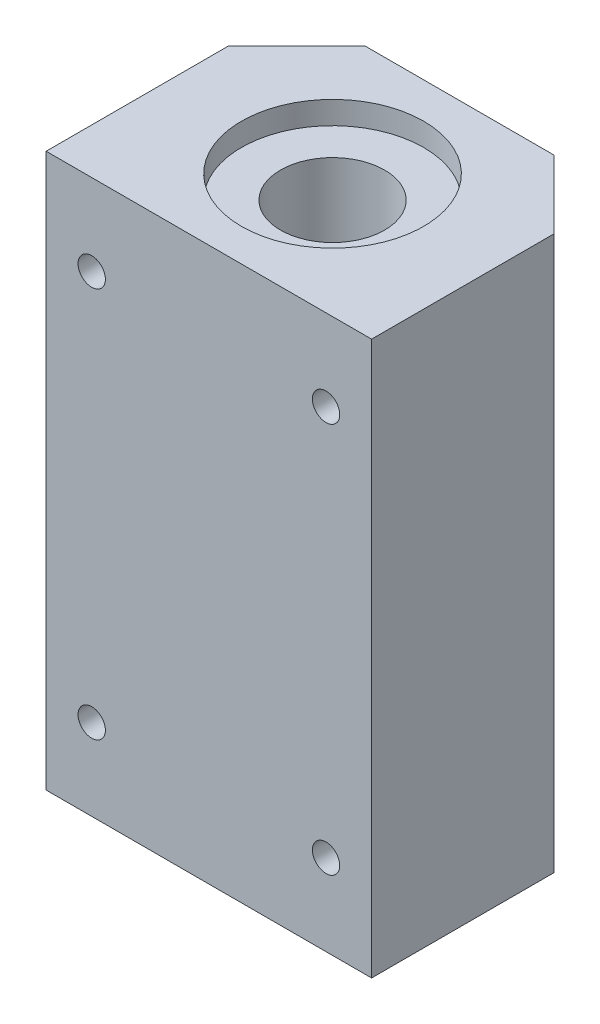
ISO-10303-21;
HEADER;
FILE_DESCRIPTION(('STEP AP214'),'2;1');
FILE_NAME('part.step','',(''),(''),'','','');
FILE_SCHEMA(('AUTOMOTIVE_DESIGN { 1 0 10303 214 1 1 1 1 }'));
ENDSEC;
DATA;
#1=APPLICATION_CONTEXT('core data for automotive mechanical design processes');
#2=APPLICATION_PROTOCOL_DEFINITION('international standard','automotive_design',2000,#1);
#3=PRODUCT_CONTEXT('',#1,'mechanical');
#4=PRODUCT('Part','Part','',(#3));
#5=PRODUCT_RELATED_PRODUCT_CATEGORY('part','',(#4));
#6=PRODUCT_DEFINITION_FORMATION('','',#4);
#7=PRODUCT_DEFINITION_CONTEXT('part definition',#1,'design');
#8=PRODUCT_DEFINITION('design','',#6,#7);
#9=PRODUCT_DEFINITION_SHAPE('','',#8);
#10=(LENGTH_UNIT() NAMED_UNIT(*) SI_UNIT(.MILLI.,.METRE.));
#11=(NAMED_UNIT(*) PLANE_ANGLE_UNIT() SI_UNIT($,.RADIAN.));
#12=(NAMED_UNIT(*) SI_UNIT($,.STERADIAN.) SOLID_ANGLE_UNIT());
#13=UNCERTAINTY_MEASURE_WITH_UNIT(LENGTH_MEASURE(1.E-05),#10,'distance_accuracy_value','');
#14=(GEOMETRIC_REPRESENTATION_CONTEXT(3) GLOBAL_UNCERTAINTY_ASSIGNED_CONTEXT((#13)) GLOBAL_UNIT_ASSIGNED_CONTEXT((#10,
#11,#12)) REPRESENTATION_CONTEXT('',''));
#15=CARTESIAN_POINT('',(0.,0.,0.));
#16=DIRECTION('',(0.,0.,1.));
#17=DIRECTION('',(1.,0.,0.));
#18=AXIS2_PLACEMENT_3D('',#15,#16,#17);
#19=CARTESIAN_POINT('',(0.,-42.5,19.5));
#20=DIRECTION('',(0.,1.,0.));
#21=DIRECTION('',(0.,0.,1.));
#22=AXIS2_PLACEMENT_3D('',#19,#20,#21);
#23=CYLINDRICAL_SURFACE('',#22,14.);
#24=CARTESIAN_POINT('',(0.,42.5,19.5));
#25=DIRECTION('',(0.,1.,0.));
#26=DIRECTION('',(0.,0.,1.));
#27=AXIS2_PLACEMENT_3D('',#24,#25,#26);
#28=CIRCLE('',#27,14.);
#29=CARTESIAN_POINT('',(0.,42.5,33.5));
#30=VERTEX_POINT('',#29);
#31=EDGE_CURVE('E154',#30,#30,#28,.T.);
#32=ORIENTED_EDGE('',*,*,#31,.T.);
#33=EDGE_LOOP('',(#32));
#34=FACE_BOUND('',#33,.T.);
#35=CARTESIAN_POINT('',(0.,39.,19.5));
#36=DIRECTION('',(0.,-1.,0.));
#37=DIRECTION('',(0.,0.,-1.));
#38=AXIS2_PLACEMENT_3D('',#35,#36,#37);
#39=CIRCLE('',#38,14.);
#40=CARTESIAN_POINT('',(0.,39.,5.49999999999999));
#41=VERTEX_POINT('',#40);
#42=EDGE_CURVE('E11',#41,#41,#39,.F.);
#43=ORIENTED_EDGE('',*,*,#42,.F.);
#44=EDGE_LOOP('',(#43));
#45=FACE_BOUND('',#44,.T.);
#46=ADVANCED_FACE('F43',(#34,#45),#23,.F.);
#47=CARTESIAN_POINT('',(25.,42.5,38.5));
#48=DIRECTION('',(-1.,0.,0.));
#49=DIRECTION('',(0.,-1.,0.));
#50=AXIS2_PLACEMENT_3D('',#47,#48,#49);
#51=PLANE('',#50);
#52=DIRECTION('',(0.,0.,-1.));
#53=VECTOR('',#52,1.);
#54=CARTESIAN_POINT('',(25.,-42.5,38.5));
#55=LINE('',#54,#53);
#56=CARTESIAN_POINT('',(25.,-42.5,38.5));
#57=VERTEX_POINT('',#56);
#58=CARTESIAN_POINT('',(25.,-42.5,10.5));
#59=VERTEX_POINT('',#58);
#60=EDGE_CURVE('E122',#57,#59,#55,.T.);
#61=ORIENTED_EDGE('',*,*,#60,.T.);
#62=DIRECTION('',(0.,1.,0.));
#63=VECTOR('',#62,1.);
#64=CARTESIAN_POINT('',(25.,-42.5,10.5));
#65=LINE('',#64,#63);
#66=CARTESIAN_POINT('',(25.,42.5,10.5));
#67=VERTEX_POINT('',#66);
#68=EDGE_CURVE('E195',#59,#67,#65,.T.);
#69=ORIENTED_EDGE('',*,*,#68,.T.);
#70=DIRECTION('',(0.,0.,-1.));
#71=VECTOR('',#70,1.);
#72=CARTESIAN_POINT('',(25.,42.5,38.5));
#73=LINE('',#72,#71);
#74=CARTESIAN_POINT('',(25.,42.5,38.5));
#75=VERTEX_POINT('',#74);
#76=EDGE_CURVE('E52',#75,#67,#73,.T.);
#77=ORIENTED_EDGE('',*,*,#76,.F.);
#78=DIRECTION('',(0.,1.,0.));
#79=VECTOR('',#78,1.);
#80=CARTESIAN_POINT('',(25.,42.5,38.5));
#81=LINE('',#80,#79);
#82=EDGE_CURVE('E173',#57,#75,#81,.T.);
#83=ORIENTED_EDGE('',*,*,#82,.F.);
#84=EDGE_LOOP('',(#61,#69,#77,#83));
#85=FACE_BOUND('',#84,.T.);
#86=ADVANCED_FACE('F45',(#85),#51,.F.);
#87=CARTESIAN_POINT('',(-25.,42.5,38.5));
#88=DIRECTION('',(0.,-1.,0.));
#89=DIRECTION('',(0.,0.,-1.));
#90=AXIS2_PLACEMENT_3D('',#87,#88,#89);
#91=PLANE('',#90);
#92=ORIENTED_EDGE('',*,*,#31,.F.);
#93=EDGE_LOOP('',(#92));
#94=FACE_BOUND('',#93,.T.);
#95=DIRECTION('',(-1.,0.,0.));
#96=VECTOR('',#95,1.);
#97=CARTESIAN_POINT('',(-25.,42.5,0.));
#98=LINE('',#97,#96);
#99=CARTESIAN_POINT('',(14.5,42.5,0.));
#100=VERTEX_POINT('',#99);
#101=CARTESIAN_POINT('',(-14.5,42.5,0.));
#102=VERTEX_POINT('',#101);
#103=EDGE_CURVE('E172',#100,#102,#98,.T.);
#104=ORIENTED_EDGE('',*,*,#103,.T.);
#105=DIRECTION('',(0.707106781186548,0.,-0.707106781186547));
#106=VECTOR('',#105,1.);
#107=CARTESIAN_POINT('',(-25.,42.5,10.5));
#108=LINE('',#107,#106);
#109=CARTESIAN_POINT('',(-25.,42.5,10.5));
#110=VERTEX_POINT('',#109);
#111=EDGE_CURVE('E59',#110,#102,#108,.T.);
#112=ORIENTED_EDGE('',*,*,#111,.F.);
#113=DIRECTION('',(0.,0.,-1.));
#114=VECTOR('',#113,1.);
#115=CARTESIAN_POINT('',(-25.,42.5,38.5));
#116=LINE('',#115,#114);
#117=CARTESIAN_POINT('',(-25.,42.5,38.5));
#118=VERTEX_POINT('',#117);
#119=EDGE_CURVE('E115',#118,#110,#116,.T.);
#120=ORIENTED_EDGE('',*,*,#119,.F.);
#121=DIRECTION('',(-1.,0.,0.));
#122=VECTOR('',#121,1.);
#123=CARTESIAN_POINT('',(-25.,42.5,38.5));
#124=LINE('',#123,#122);
#125=EDGE_CURVE('E177',#75,#118,#124,.T.);
#126=ORIENTED_EDGE('',*,*,#125,.F.);
#127=ORIENTED_EDGE('',*,*,#76,.T.);
#128=DIRECTION('',(0.707106781186548,0.,0.707106781186547));
#129=VECTOR('',#128,1.);
#130=CARTESIAN_POINT('',(25.,42.5,10.5));
#131=LINE('',#130,#129);
#132=EDGE_CURVE('E201',#100,#67,#131,.T.);
#133=ORIENTED_EDGE('',*,*,#132,.F.);
#134=EDGE_LOOP('',(#104,#112,#120,#126,#127,#133));
#135=FACE_BOUND('',#134,.T.);
#136=ADVANCED_FACE('F253',(#94,#135),#91,.F.);
#137=CARTESIAN_POINT('',(-25.,42.5,38.5));
#138=DIRECTION('',(1.,0.,0.));
#139=DIRECTION('',(0.,1.,0.));
#140=AXIS2_PLACEMENT_3D('',#137,#138,#139);
#141=PLANE('',#140);
#142=ORIENTED_EDGE('',*,*,#119,.T.);
#143=DIRECTION('',(0.,1.,0.));
#144=VECTOR('',#143,1.);
#145=CARTESIAN_POINT('',(-25.,-42.5,10.5));
#146=LINE('',#145,#144);
#147=CARTESIAN_POINT('',(-25.,-42.5,10.5));
#148=VERTEX_POINT('',#147);
#149=EDGE_CURVE('E99',#148,#110,#146,.T.);
#150=ORIENTED_EDGE('',*,*,#149,.F.);
#151=DIRECTION('',(0.,0.,-1.));
#152=VECTOR('',#151,1.);
#153=CARTESIAN_POINT('',(-25.,-42.5,38.5));
#154=LINE('',#153,#152);
#155=CARTESIAN_POINT('',(-25.,-42.5,38.5));
#156=VERTEX_POINT('',#155);
#157=EDGE_CURVE('E112',#156,#148,#154,.T.);
#158=ORIENTED_EDGE('',*,*,#157,.F.);
#159=DIRECTION('',(0.,-1.,0.));
#160=VECTOR('',#159,1.);
#161=CARTESIAN_POINT('',(-25.,42.5,38.5));
#162=LINE('',#161,#160);
#163=EDGE_CURVE('E181',#118,#156,#162,.T.);
#164=ORIENTED_EDGE('',*,*,#163,.F.);
#165=EDGE_LOOP('',(#142,#150,#158,#164));
#166=FACE_BOUND('',#165,.T.);
#167=ADVANCED_FACE('F110',(#166),#141,.F.);
#168=CARTESIAN_POINT('',(-25.,-42.5,38.5));
#169=DIRECTION('',(0.,1.,0.));
#170=DIRECTION('',(0.,0.,1.));
#171=AXIS2_PLACEMENT_3D('',#168,#169,#170);
#172=PLANE('',#171);
#173=CARTESIAN_POINT('',(0.,-42.5,19.5));
#174=DIRECTION('',(0.,1.,0.));
#175=DIRECTION('',(0.,0.,1.));
#176=AXIS2_PLACEMENT_3D('',#173,#174,#175);
#177=CIRCLE('',#176,14.);
#178=CARTESIAN_POINT('',(0.,-42.5,33.5));
#179=VERTEX_POINT('',#178);
#180=EDGE_CURVE('E204',#179,#179,#177,.T.);
#181=ORIENTED_EDGE('',*,*,#180,.T.);
#182=EDGE_LOOP('',(#181));
#183=FACE_BOUND('',#182,.T.);
#184=ORIENTED_EDGE('',*,*,#157,.T.);
#185=DIRECTION('',(0.707106781186548,0.,-0.707106781186547));
#186=VECTOR('',#185,1.);
#187=CARTESIAN_POINT('',(-25.,-42.5,10.5));
#188=LINE('',#187,#186);
#189=CARTESIAN_POINT('',(-14.5,-42.5,0.));
#190=VERTEX_POINT('',#189);
#191=EDGE_CURVE('E95',#148,#190,#188,.T.);
#192=ORIENTED_EDGE('',*,*,#191,.T.);
#193=DIRECTION('',(1.,0.,0.));
#194=VECTOR('',#193,1.);
#195=CARTESIAN_POINT('',(-25.,-42.5,0.));
#196=LINE('',#195,#194);
#197=CARTESIAN_POINT('',(14.5,-42.5,0.));
#198=VERTEX_POINT('',#197);
#199=EDGE_CURVE('E178',#190,#198,#196,.T.);
#200=ORIENTED_EDGE('',*,*,#199,.T.);
#201=DIRECTION('',(0.707106781186548,0.,0.707106781186547));
#202=VECTOR('',#201,1.);
#203=CARTESIAN_POINT('',(25.,-42.5,10.5));
#204=LINE('',#203,#202);
#205=EDGE_CURVE('E67',#198,#59,#204,.T.);
#206=ORIENTED_EDGE('',*,*,#205,.T.);
#207=ORIENTED_EDGE('',*,*,#60,.F.);
#208=DIRECTION('',(1.,0.,0.));
#209=VECTOR('',#208,1.);
#210=CARTESIAN_POINT('',(-25.,-42.5,38.5));
#211=LINE('',#210,#209);
#212=EDGE_CURVE('E120',#156,#57,#211,.T.);
#213=ORIENTED_EDGE('',*,*,#212,.F.);
#214=EDGE_LOOP('',(#184,#192,#200,#206,#207,#213));
#215=FACE_BOUND('',#214,.T.);
#216=ADVANCED_FACE('F118',(#183,#215),#172,.F.);
#217=CARTESIAN_POINT('',(0.,0.,38.5));
#218=DIRECTION('',(0.,0.,1.));
#219=DIRECTION('',(1.,0.,0.));
#220=AXIS2_PLACEMENT_3D('',#217,#218,#219);
#221=PLANE('',#220);
#222=CARTESIAN_POINT('',(-18.,30.,38.5));
#223=DIRECTION('',(0.,0.,1.));
#224=DIRECTION('',(1.,0.,0.));
#225=AXIS2_PLACEMENT_3D('',#222,#223,#224);
#226=CIRCLE('',#225,2.09999999999999);
#227=CARTESIAN_POINT('',(-15.9,30.,38.5));
#228=VERTEX_POINT('',#227);
#229=EDGE_CURVE('E147',#228,#228,#226,.T.);
#230=ORIENTED_EDGE('',*,*,#229,.F.);
#231=EDGE_LOOP('',(#230));
#232=FACE_BOUND('',#231,.T.);
#233=CARTESIAN_POINT('',(18.,30.,38.5));
#234=DIRECTION('',(0.,0.,1.));
#235=DIRECTION('',(1.,0.,0.));
#236=AXIS2_PLACEMENT_3D('',#233,#234,#235);
#237=CIRCLE('',#236,2.09999999999999);
#238=CARTESIAN_POINT('',(20.1,30.,38.5));
#239=VERTEX_POINT('',#238);
#240=EDGE_CURVE('E160',#239,#239,#237,.T.);
#241=ORIENTED_EDGE('',*,*,#240,.F.);
#242=EDGE_LOOP('',(#241));
#243=FACE_BOUND('',#242,.T.);
#244=CARTESIAN_POINT('',(18.,-30.,38.5));
#245=DIRECTION('',(0.,0.,1.));
#246=DIRECTION('',(1.,0.,0.));
#247=AXIS2_PLACEMENT_3D('',#244,#245,#246);
#248=CIRCLE('',#247,2.09999999999999);
#249=CARTESIAN_POINT('',(20.1,-30.,38.5));
#250=VERTEX_POINT('',#249);
#251=EDGE_CURVE('E164',#250,#250,#248,.T.);
#252=ORIENTED_EDGE('',*,*,#251,.F.);
#253=EDGE_LOOP('',(#252));
#254=FACE_BOUND('',#253,.T.);
#255=CARTESIAN_POINT('',(-18.,-30.,38.5));
#256=DIRECTION('',(0.,0.,1.));
#257=DIRECTION('',(1.,0.,0.));
#258=AXIS2_PLACEMENT_3D('',#255,#256,#257);
#259=CIRCLE('',#258,2.09999999999999);
#260=CARTESIAN_POINT('',(-15.9,-30.,38.5));
#261=VERTEX_POINT('',#260);
#262=EDGE_CURVE('E168',#261,#261,#259,.T.);
#263=ORIENTED_EDGE('',*,*,#262,.F.);
#264=EDGE_LOOP('',(#263));
#265=FACE_BOUND('',#264,.T.);
#266=ORIENTED_EDGE('',*,*,#82,.T.);
#267=ORIENTED_EDGE('',*,*,#125,.T.);
#268=ORIENTED_EDGE('',*,*,#163,.T.);
#269=ORIENTED_EDGE('',*,*,#212,.T.);
#270=EDGE_LOOP('',(#266,#267,#268,#269));
#271=FACE_BOUND('',#270,.T.);
#272=ADVANCED_FACE('F284',(#232,#243,#254,#265,#271),#221,.T.);
#273=CARTESIAN_POINT('',(0.,0.,0.));
#274=DIRECTION('',(0.,0.,1.));
#275=DIRECTION('',(1.,0.,0.));
#276=AXIS2_PLACEMENT_3D('',#273,#274,#275);
#277=PLANE('',#276);
#278=ORIENTED_EDGE('',*,*,#199,.F.);
#279=DIRECTION('',(0.,1.,0.));
#280=VECTOR('',#279,1.);
#281=CARTESIAN_POINT('',(-14.5,-42.5,0.));
#282=LINE('',#281,#280);
#283=EDGE_CURVE('E100',#190,#102,#282,.T.);
#284=ORIENTED_EDGE('',*,*,#283,.T.);
#285=ORIENTED_EDGE('',*,*,#103,.F.);
#286=DIRECTION('',(0.,1.,0.));
#287=VECTOR('',#286,1.);
#288=CARTESIAN_POINT('',(14.5,-42.5,0.));
#289=LINE('',#288,#287);
#290=EDGE_CURVE('E192',#198,#100,#289,.T.);
#291=ORIENTED_EDGE('',*,*,#290,.F.);
#292=EDGE_LOOP('',(#278,#284,#285,#291));
#293=FACE_BOUND('',#292,.T.);
#294=ADVANCED_FACE('F190',(#293),#277,.F.);
#295=CARTESIAN_POINT('',(-18.,-30.,38.5));
#296=DIRECTION('',(0.,0.,1.));
#297=DIRECTION('',(1.,0.,0.));
#298=AXIS2_PLACEMENT_3D('',#295,#296,#297);
#299=CYLINDRICAL_SURFACE('',#298,2.09999999999999);
#300=CARTESIAN_POINT('',(-18.,-30.,3.50000000000001));
#301=DIRECTION('',(0.707106781186547,0.,0.707106781186548));
#302=DIRECTION('',(-0.707106781186548,0.,0.707106781186547));
#303=AXIS2_PLACEMENT_3D('',#300,#301,#302);
#304=ELLIPSE('',#303,2.96984848098348,2.09999999999999);
#305=CARTESIAN_POINT('',(-20.1,-30.,5.6));
#306=VERTEX_POINT('',#305);
#307=EDGE_CURVE('E137',#306,#306,#304,.F.);
#308=ORIENTED_EDGE('',*,*,#307,.T.);
#309=EDGE_LOOP('',(#308));
#310=FACE_BOUND('',#309,.T.);
#311=ORIENTED_EDGE('',*,*,#262,.T.);
#312=EDGE_LOOP('',(#311));
#313=FACE_BOUND('',#312,.T.);
#314=ADVANCED_FACE('F280',(#310,#313),#299,.F.);
#315=CARTESIAN_POINT('',(18.,-30.,38.5));
#316=DIRECTION('',(0.,0.,1.));
#317=DIRECTION('',(1.,0.,0.));
#318=AXIS2_PLACEMENT_3D('',#315,#316,#317);
#319=CYLINDRICAL_SURFACE('',#318,2.09999999999999);
#320=CARTESIAN_POINT('',(18.,-30.,3.50000000000002));
#321=DIRECTION('',(-0.707106781186547,0.,0.707106781186548));
#322=DIRECTION('',(0.707106781186548,0.,0.707106781186547));
#323=AXIS2_PLACEMENT_3D('',#320,#321,#322);
#324=ELLIPSE('',#323,2.96984848098348,2.09999999999999);
#325=CARTESIAN_POINT('',(20.1,-30.,5.60000000000001));
#326=VERTEX_POINT('',#325);
#327=EDGE_CURVE('E141',#326,#326,#324,.F.);
#328=ORIENTED_EDGE('',*,*,#327,.T.);
#329=EDGE_LOOP('',(#328));
#330=FACE_BOUND('',#329,.T.);
#331=ORIENTED_EDGE('',*,*,#251,.T.);
#332=EDGE_LOOP('',(#331));
#333=FACE_BOUND('',#332,.T.);
#334=ADVANCED_FACE('F276',(#330,#333),#319,.F.);
#335=CARTESIAN_POINT('',(18.,30.,38.5));
#336=DIRECTION('',(0.,0.,1.));
#337=DIRECTION('',(1.,0.,0.));
#338=AXIS2_PLACEMENT_3D('',#335,#336,#337);
#339=CYLINDRICAL_SURFACE('',#338,2.09999999999999);
#340=CARTESIAN_POINT('',(18.,30.,3.50000000000002));
#341=DIRECTION('',(-0.707106781186547,0.,0.707106781186548));
#342=DIRECTION('',(0.707106781186548,0.,0.707106781186547));
#343=AXIS2_PLACEMENT_3D('',#340,#341,#342);
#344=ELLIPSE('',#343,2.96984848098348,2.09999999999999);
#345=CARTESIAN_POINT('',(20.1,30.,5.60000000000001));
#346=VERTEX_POINT('',#345);
#347=EDGE_CURVE('E138',#346,#346,#344,.F.);
#348=ORIENTED_EDGE('',*,*,#347,.T.);
#349=EDGE_LOOP('',(#348));
#350=FACE_BOUND('',#349,.T.);
#351=ORIENTED_EDGE('',*,*,#240,.T.);
#352=EDGE_LOOP('',(#351));
#353=FACE_BOUND('',#352,.T.);
#354=ADVANCED_FACE('F279',(#350,#353),#339,.F.);
#355=CARTESIAN_POINT('',(-18.,30.,38.5));
#356=DIRECTION('',(0.,0.,1.));
#357=DIRECTION('',(1.,0.,0.));
#358=AXIS2_PLACEMENT_3D('',#355,#356,#357);
#359=CYLINDRICAL_SURFACE('',#358,2.09999999999999);
#360=CARTESIAN_POINT('',(-18.,30.,3.50000000000001));
#361=DIRECTION('',(0.707106781186547,0.,0.707106781186548));
#362=DIRECTION('',(-0.707106781186548,0.,0.707106781186547));
#363=AXIS2_PLACEMENT_3D('',#360,#361,#362);
#364=ELLIPSE('',#363,2.96984848098348,2.09999999999999);
#365=CARTESIAN_POINT('',(-20.1,30.,5.6));
#366=VERTEX_POINT('',#365);
#367=EDGE_CURVE('E134',#366,#366,#364,.F.);
#368=ORIENTED_EDGE('',*,*,#367,.T.);
#369=EDGE_LOOP('',(#368));
#370=FACE_BOUND('',#369,.T.);
#371=ORIENTED_EDGE('',*,*,#229,.T.);
#372=EDGE_LOOP('',(#371));
#373=FACE_BOUND('',#372,.T.);
#374=ADVANCED_FACE('F270',(#370,#373),#359,.F.);
#375=CARTESIAN_POINT('',(-25.,-42.5,10.5));
#376=DIRECTION('',(0.707106781186547,0.,0.707106781186548));
#377=DIRECTION('',(0.707106781186548,0.,-0.707106781186547));
#378=AXIS2_PLACEMENT_3D('',#375,#376,#377);
#379=PLANE('',#378);
#380=ORIENTED_EDGE('',*,*,#367,.F.);
#381=EDGE_LOOP('',(#380));
#382=FACE_BOUND('',#381,.T.);
#383=ORIENTED_EDGE('',*,*,#111,.T.);
#384=ORIENTED_EDGE('',*,*,#283,.F.);
#385=ORIENTED_EDGE('',*,*,#191,.F.);
#386=ORIENTED_EDGE('',*,*,#149,.T.);
#387=EDGE_LOOP('',(#383,#384,#385,#386));
#388=FACE_BOUND('',#387,.T.);
#389=ORIENTED_EDGE('',*,*,#307,.F.);
#390=EDGE_LOOP('',(#389));
#391=FACE_BOUND('',#390,.T.);
#392=ADVANCED_FACE('F97',(#382,#388,#391),#379,.F.);
#393=CARTESIAN_POINT('',(25.,-42.5,10.5));
#394=DIRECTION('',(-0.707106781186547,0.,0.707106781186548));
#395=DIRECTION('',(0.707106781186548,0.,0.707106781186547));
#396=AXIS2_PLACEMENT_3D('',#393,#394,#395);
#397=PLANE('',#396);
#398=ORIENTED_EDGE('',*,*,#347,.F.);
#399=EDGE_LOOP('',(#398));
#400=FACE_BOUND('',#399,.T.);
#401=ORIENTED_EDGE('',*,*,#132,.T.);
#402=ORIENTED_EDGE('',*,*,#68,.F.);
#403=ORIENTED_EDGE('',*,*,#205,.F.);
#404=ORIENTED_EDGE('',*,*,#290,.T.);
#405=EDGE_LOOP('',(#401,#402,#403,#404));
#406=FACE_BOUND('',#405,.T.);
#407=ORIENTED_EDGE('',*,*,#327,.F.);
#408=EDGE_LOOP('',(#407));
#409=FACE_BOUND('',#408,.T.);
#410=ADVANCED_FACE('F259',(#400,#406,#409),#397,.F.);
#411=CARTESIAN_POINT('',(0.,-39.,19.5));
#412=DIRECTION('',(0.,-1.,0.));
#413=DIRECTION('',(0.,0.,-1.));
#414=AXIS2_PLACEMENT_3D('',#411,#412,#413);
#415=CIRCLE('',#414,14.);
#416=CARTESIAN_POINT('',(0.,-39.,5.49999999999999));
#417=VERTEX_POINT('',#416);
#418=EDGE_CURVE('E212',#417,#417,#415,.T.);
#419=ORIENTED_EDGE('',*,*,#418,.F.);
#420=EDGE_LOOP('',(#419));
#421=FACE_BOUND('',#420,.T.);
#422=ORIENTED_EDGE('',*,*,#180,.F.);
#423=EDGE_LOOP('',(#422));
#424=FACE_BOUND('',#423,.T.);
#425=ADVANCED_FACE('F249',(#421,#424),#23,.F.);
#426=CARTESIAN_POINT('',(0.,-39.,19.5));
#427=DIRECTION('',(0.,-1.,0.));
#428=DIRECTION('',(0.,0.,-1.));
#429=AXIS2_PLACEMENT_3D('',#426,#427,#428);
#430=PLANE('',#429);
#431=ORIENTED_EDGE('',*,*,#418,.T.);
#432=EDGE_LOOP('',(#431));
#433=FACE_BOUND('',#432,.T.);
#434=CARTESIAN_POINT('',(0.,-39.,19.5));
#435=DIRECTION('',(0.,-1.,0.));
#436=DIRECTION('',(0.,0.,-1.));
#437=AXIS2_PLACEMENT_3D('',#434,#435,#436);
#438=CIRCLE('',#437,8.);
#439=CARTESIAN_POINT('',(0.,-39.,11.5));
#440=VERTEX_POINT('',#439);
#441=EDGE_CURVE('E217',#440,#440,#438,.T.);
#442=ORIENTED_EDGE('',*,*,#441,.F.);
#443=EDGE_LOOP('',(#442));
#444=FACE_BOUND('',#443,.T.);
#445=ADVANCED_FACE('F243',(#433,#444),#430,.T.);
#446=CARTESIAN_POINT('',(0.,39.,19.5));
#447=DIRECTION('',(0.,-1.,0.));
#448=DIRECTION('',(0.,0.,-1.));
#449=AXIS2_PLACEMENT_3D('',#446,#447,#448);
#450=PLANE('',#449);
#451=ORIENTED_EDGE('',*,*,#42,.T.);
#452=EDGE_LOOP('',(#451));
#453=FACE_BOUND('',#452,.T.);
#454=CARTESIAN_POINT('',(0.,39.,19.5));
#455=DIRECTION('',(0.,-1.,0.));
#456=DIRECTION('',(0.,0.,-1.));
#457=AXIS2_PLACEMENT_3D('',#454,#455,#456);
#458=CIRCLE('',#457,8.);
#459=CARTESIAN_POINT('',(0.,39.,11.5));
#460=VERTEX_POINT('',#459);
#461=EDGE_CURVE('E223',#460,#460,#458,.T.);
#462=ORIENTED_EDGE('',*,*,#461,.T.);
#463=EDGE_LOOP('',(#462));
#464=FACE_BOUND('',#463,.T.);
#465=ADVANCED_FACE('F234',(#453,#464),#450,.F.);
#466=CARTESIAN_POINT('',(0.,-39.,19.5));
#467=DIRECTION('',(0.,1.,0.));
#468=DIRECTION('',(0.,0.,1.));
#469=AXIS2_PLACEMENT_3D('',#466,#467,#468);
#470=CYLINDRICAL_SURFACE('',#469,8.);
#471=ORIENTED_EDGE('',*,*,#441,.T.);
#472=EDGE_LOOP('',(#471));
#473=FACE_BOUND('',#472,.T.);
#474=ORIENTED_EDGE('',*,*,#461,.F.);
#475=EDGE_LOOP('',(#474));
#476=FACE_BOUND('',#475,.T.);
#477=ADVANCED_FACE('F236',(#473,#476),#470,.F.);
#478=CLOSED_SHELL('',(#46,#86,#136,#167,#216,#272,#294,#314,#334,#354,#374,#392,#410,#425,#445,
#465,#477));
#479=MANIFOLD_SOLID_BREP('B2',#478);
#480=ADVANCED_BREP_SHAPE_REPRESENTATION('',(#18,#479),#14);
#481=SHAPE_DEFINITION_REPRESENTATION(#9,#480);
ENDSEC;
END-ISO-10303-21;
